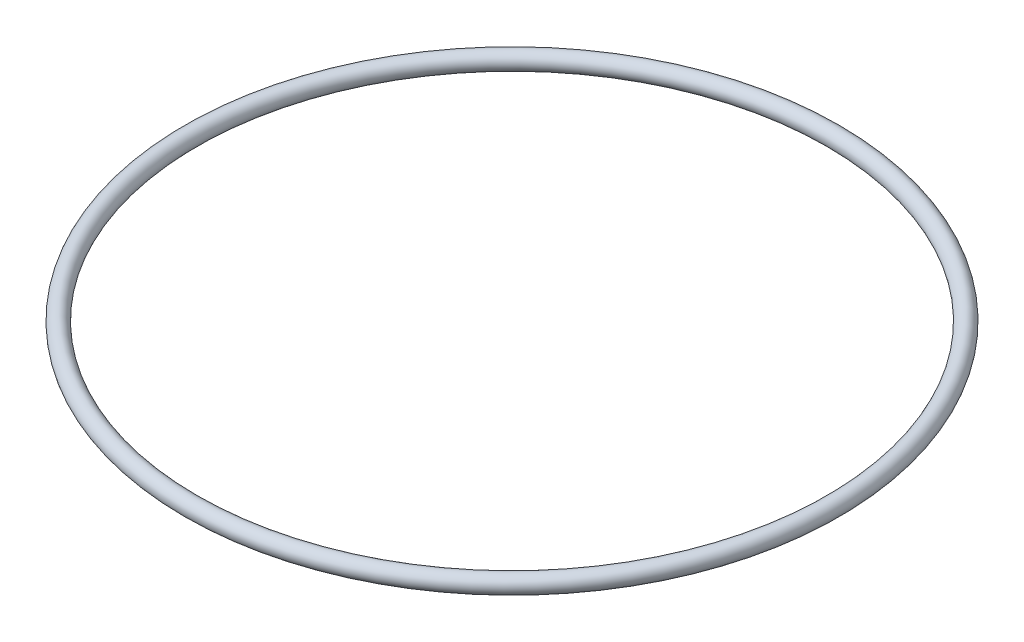
ISO-10303-21;
HEADER;
FILE_DESCRIPTION(('STEP AP214'),'2;1');
FILE_NAME('part.step','',(''),(''),'','','');
FILE_SCHEMA(('AUTOMOTIVE_DESIGN { 1 0 10303 214 1 1 1 1 }'));
ENDSEC;
DATA;
#1=APPLICATION_CONTEXT('core data for automotive mechanical design processes');
#2=APPLICATION_PROTOCOL_DEFINITION('international standard','automotive_design',2000,#1);
#3=PRODUCT_CONTEXT('',#1,'mechanical');
#4=PRODUCT('Part','Part','',(#3));
#5=PRODUCT_RELATED_PRODUCT_CATEGORY('part','',(#4));
#6=PRODUCT_DEFINITION_FORMATION('','',#4);
#7=PRODUCT_DEFINITION_CONTEXT('part definition',#1,'design');
#8=PRODUCT_DEFINITION('design','',#6,#7);
#9=PRODUCT_DEFINITION_SHAPE('','',#8);
#10=(LENGTH_UNIT() NAMED_UNIT(*) SI_UNIT(.MILLI.,.METRE.));
#11=(NAMED_UNIT(*) PLANE_ANGLE_UNIT() SI_UNIT($,.RADIAN.));
#12=(NAMED_UNIT(*) SI_UNIT($,.STERADIAN.) SOLID_ANGLE_UNIT());
#13=UNCERTAINTY_MEASURE_WITH_UNIT(LENGTH_MEASURE(1.E-05),#10,'distance_accuracy_value','');
#14=(GEOMETRIC_REPRESENTATION_CONTEXT(3) GLOBAL_UNCERTAINTY_ASSIGNED_CONTEXT((#13)) GLOBAL_UNIT_ASSIGNED_CONTEXT((#10,
#11,#12)) REPRESENTATION_CONTEXT('',''));
#15=CARTESIAN_POINT('',(0.,0.,0.));
#16=DIRECTION('',(0.,0.,1.));
#17=DIRECTION('',(1.,0.,0.));
#18=AXIS2_PLACEMENT_3D('',#15,#16,#17);
#19=CARTESIAN_POINT('',(0.,0.,0.));
#20=DIRECTION('',(0.,1.,0.));
#21=DIRECTION('',(0.,0.,1.));
#22=AXIS2_PLACEMENT_3D('',#19,#20,#21);
#23=TOROIDAL_SURFACE('',#22,29.36875,0.793749999999999);
#24=CARTESIAN_POINT('',(0.,0.,30.1625));
#25=VERTEX_POINT('',#24);
#26=VERTEX_LOOP('',#25);
#27=FACE_BOUND('',#26,.T.);
#28=ADVANCED_FACE('F29',(#27),#23,.T.);
#29=CLOSED_SHELL('',(#28));
#30=MANIFOLD_SOLID_BREP('B2',#29);
#31=ADVANCED_BREP_SHAPE_REPRESENTATION('',(#18,#30),#14);
#32=SHAPE_DEFINITION_REPRESENTATION(#9,#31);
ENDSEC;
END-ISO-10303-21;
